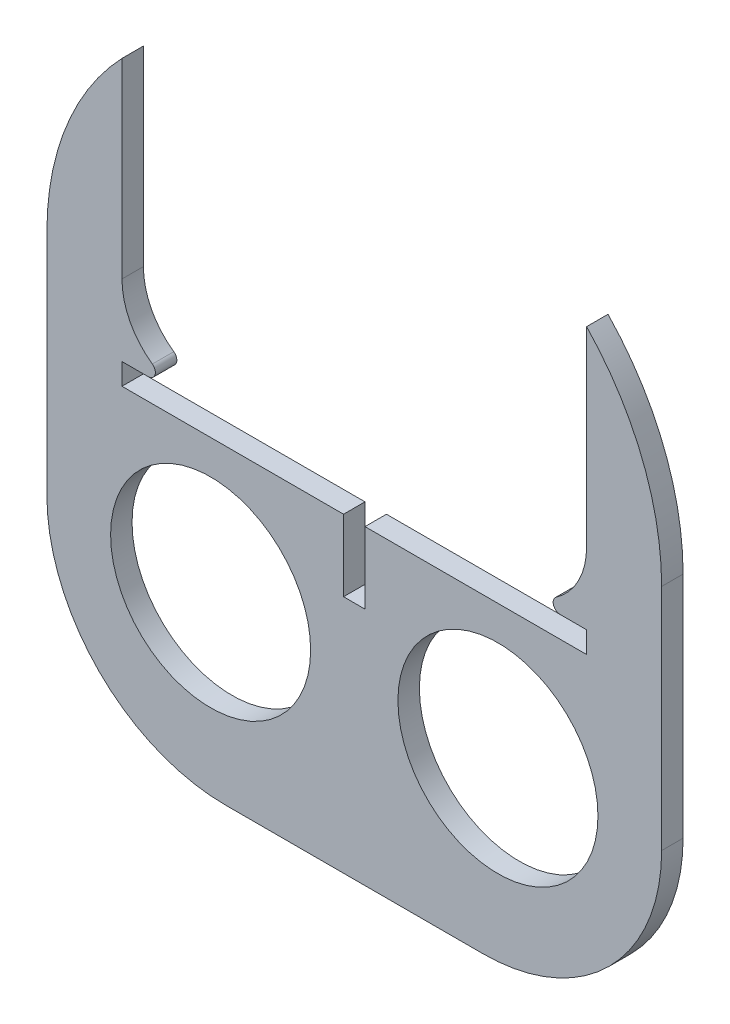
ISO-10303-21;
HEADER;
FILE_DESCRIPTION(('STEP AP214'),'2;1');
FILE_NAME('part.step','',(''),(''),'','','');
FILE_SCHEMA(('AUTOMOTIVE_DESIGN { 1 0 10303 214 1 1 1 1 }'));
ENDSEC;
DATA;
#1=APPLICATION_CONTEXT('core data for automotive mechanical design processes');
#2=APPLICATION_PROTOCOL_DEFINITION('international standard','automotive_design',2000,#1);
#3=PRODUCT_CONTEXT('',#1,'mechanical');
#4=PRODUCT('Part','Part','',(#3));
#5=PRODUCT_RELATED_PRODUCT_CATEGORY('part','',(#4));
#6=PRODUCT_DEFINITION_FORMATION('','',#4);
#7=PRODUCT_DEFINITION_CONTEXT('part definition',#1,'design');
#8=PRODUCT_DEFINITION('design','',#6,#7);
#9=PRODUCT_DEFINITION_SHAPE('','',#8);
#10=(LENGTH_UNIT() NAMED_UNIT(*) SI_UNIT(.MILLI.,.METRE.));
#11=(NAMED_UNIT(*) PLANE_ANGLE_UNIT() SI_UNIT($,.RADIAN.));
#12=(NAMED_UNIT(*) SI_UNIT($,.STERADIAN.) SOLID_ANGLE_UNIT());
#13=UNCERTAINTY_MEASURE_WITH_UNIT(LENGTH_MEASURE(1.E-05),#10,'distance_accuracy_value','');
#14=(GEOMETRIC_REPRESENTATION_CONTEXT(3) GLOBAL_UNCERTAINTY_ASSIGNED_CONTEXT((#13)) GLOBAL_UNIT_ASSIGNED_CONTEXT((#10,
#11,#12)) REPRESENTATION_CONTEXT('',''));
#15=CARTESIAN_POINT('',(0.,0.,0.));
#16=DIRECTION('',(0.,0.,1.));
#17=DIRECTION('',(1.,0.,0.));
#18=AXIS2_PLACEMENT_3D('',#15,#16,#17);
#19=CARTESIAN_POINT('',(-4.99999999999999,-29.5,3.));
#20=DIRECTION('',(0.,0.,-1.));
#21=DIRECTION('',(-1.,0.,0.));
#22=AXIS2_PLACEMENT_3D('',#19,#20,#21);
#23=PLANE('',#22);
#24=CARTESIAN_POINT('',(22.5,-30.,3.));
#25=DIRECTION('',(0.,0.,1.));
#26=DIRECTION('',(1.,0.,0.));
#27=AXIS2_PLACEMENT_3D('',#24,#25,#26);
#28=CIRCLE('',#27,10.);
#29=CARTESIAN_POINT('',(28.2495957457607,-38.1818181818182,3.));
#30=VERTEX_POINT('',#29);
#31=CARTESIAN_POINT('',(32.5,-30.,3.));
#32=VERTEX_POINT('',#31);
#33=EDGE_CURVE('E251',#30,#32,#28,.T.);
#34=ORIENTED_EDGE('',*,*,#33,.F.);
#35=CARTESIAN_POINT('',(28.8245553203367,-39.,3.));
#36=DIRECTION('',(0.,0.,-1.));
#37=DIRECTION('',(-1.,0.,0.));
#38=AXIS2_PLACEMENT_3D('',#35,#36,#37);
#39=CIRCLE('',#38,1.);
#40=CARTESIAN_POINT('',(28.8245553203367,-40.,3.));
#41=VERTEX_POINT('',#40);
#42=EDGE_CURVE('E349',#30,#41,#39,.F.);
#43=ORIENTED_EDGE('',*,*,#42,.T.);
#44=DIRECTION('',(1.,0.,0.));
#45=VECTOR('',#44,1.);
#46=CARTESIAN_POINT('',(0.,-40.,3.));
#47=LINE('',#46,#45);
#48=CARTESIAN_POINT('',(32.5,-40.,3.));
#49=VERTEX_POINT('',#48);
#50=EDGE_CURVE('E225',#41,#49,#47,.T.);
#51=ORIENTED_EDGE('',*,*,#50,.T.);
#52=DIRECTION('',(0.,1.,0.));
#53=VECTOR('',#52,1.);
#54=CARTESIAN_POINT('',(32.5,0.,3.));
#55=LINE('',#54,#53);
#56=CARTESIAN_POINT('',(32.5,-43.,3.));
#57=VERTEX_POINT('',#56);
#58=EDGE_CURVE('E222',#57,#49,#55,.T.);
#59=ORIENTED_EDGE('',*,*,#58,.F.);
#60=DIRECTION('',(1.,0.,0.));
#61=VECTOR('',#60,1.);
#62=CARTESIAN_POINT('',(0.,-43.,3.));
#63=LINE('',#62,#61);
#64=CARTESIAN_POINT('',(1.5,-43.,3.));
#65=VERTEX_POINT('',#64);
#66=EDGE_CURVE('E209',#65,#57,#63,.T.);
#67=ORIENTED_EDGE('',*,*,#66,.F.);
#68=DIRECTION('',(0.,1.,0.));
#69=VECTOR('',#68,1.);
#70=CARTESIAN_POINT('',(1.5,0.,3.));
#71=LINE('',#70,#69);
#72=CARTESIAN_POINT('',(1.5,-53.,3.));
#73=VERTEX_POINT('',#72);
#74=EDGE_CURVE('E216',#73,#65,#71,.T.);
#75=ORIENTED_EDGE('',*,*,#74,.F.);
#76=DIRECTION('',(1.,0.,0.));
#77=VECTOR('',#76,1.);
#78=CARTESIAN_POINT('',(0.,-53.,3.));
#79=LINE('',#78,#77);
#80=CARTESIAN_POINT('',(-1.5,-53.,3.));
#81=VERTEX_POINT('',#80);
#82=EDGE_CURVE('E214',#81,#73,#79,.T.);
#83=ORIENTED_EDGE('',*,*,#82,.F.);
#84=DIRECTION('',(0.,1.,0.));
#85=VECTOR('',#84,1.);
#86=CARTESIAN_POINT('',(-1.5,0.,3.));
#87=LINE('',#86,#85);
#88=CARTESIAN_POINT('',(-1.5,-43.,3.));
#89=VERTEX_POINT('',#88);
#90=EDGE_CURVE('E190',#81,#89,#87,.T.);
#91=ORIENTED_EDGE('',*,*,#90,.T.);
#92=CARTESIAN_POINT('',(-32.5,-43.,3.));
#93=VERTEX_POINT('',#92);
#94=EDGE_CURVE('E200',#93,#89,#63,.T.);
#95=ORIENTED_EDGE('',*,*,#94,.F.);
#96=DIRECTION('',(0.,1.,0.));
#97=VECTOR('',#96,1.);
#98=CARTESIAN_POINT('',(-32.5,0.,3.));
#99=LINE('',#98,#97);
#100=CARTESIAN_POINT('',(-32.5,-40.,3.));
#101=VERTEX_POINT('',#100);
#102=EDGE_CURVE('E197',#93,#101,#99,.T.);
#103=ORIENTED_EDGE('',*,*,#102,.T.);
#104=CARTESIAN_POINT('',(-28.8245553203368,-40.,3.));
#105=VERTEX_POINT('',#104);
#106=EDGE_CURVE('E226',#101,#105,#47,.T.);
#107=ORIENTED_EDGE('',*,*,#106,.T.);
#108=CARTESIAN_POINT('',(-28.8245553203368,-39.,3.));
#109=DIRECTION('',(0.,0.,-1.));
#110=DIRECTION('',(-1.,0.,0.));
#111=AXIS2_PLACEMENT_3D('',#108,#109,#110);
#112=CIRCLE('',#111,1.);
#113=CARTESIAN_POINT('',(-28.2495957457607,-38.1818181818182,3.));
#114=VERTEX_POINT('',#113);
#115=EDGE_CURVE('E347',#105,#114,#112,.F.);
#116=ORIENTED_EDGE('',*,*,#115,.T.);
#117=CARTESIAN_POINT('',(-22.5,-30.,3.));
#118=DIRECTION('',(0.,0.,1.));
#119=DIRECTION('',(-1.,0.,0.));
#120=AXIS2_PLACEMENT_3D('',#117,#118,#119);
#121=CIRCLE('',#120,10.);
#122=CARTESIAN_POINT('',(-32.5,-30.,3.));
#123=VERTEX_POINT('',#122);
#124=EDGE_CURVE('E249',#123,#114,#121,.T.);
#125=ORIENTED_EDGE('',*,*,#124,.F.);
#126=DIRECTION('',(0.,-1.,0.));
#127=VECTOR('',#126,1.);
#128=CARTESIAN_POINT('',(-32.5,-30.,3.));
#129=LINE('',#128,#127);
#130=CARTESIAN_POINT('',(-32.5,-3.27501191611332,3.));
#131=VERTEX_POINT('',#130);
#132=EDGE_CURVE('E246',#131,#123,#129,.T.);
#133=ORIENTED_EDGE('',*,*,#132,.F.);
#134=CARTESIAN_POINT('',(-4.99999999999999,-29.5,3.));
#135=DIRECTION('',(0.,0.,1.));
#136=DIRECTION('',(-1.,0.,0.));
#137=AXIS2_PLACEMENT_3D('',#134,#135,#136);
#138=CIRCLE('',#137,38.);
#139=CARTESIAN_POINT('',(-43.,-29.5,3.));
#140=VERTEX_POINT('',#139);
#141=EDGE_CURVE('E267',#131,#140,#138,.T.);
#142=ORIENTED_EDGE('',*,*,#141,.T.);
#143=DIRECTION('',(0.,-1.,0.));
#144=VECTOR('',#143,1.);
#145=CARTESIAN_POINT('',(-43.,-29.5,3.));
#146=LINE('',#145,#144);
#147=CARTESIAN_POINT('',(-43.,-61.5,3.));
#148=VERTEX_POINT('',#147);
#149=EDGE_CURVE('E269',#140,#148,#146,.T.);
#150=ORIENTED_EDGE('',*,*,#149,.T.);
#151=CARTESIAN_POINT('',(-18.,-61.5,3.));
#152=DIRECTION('',(0.,0.,1.));
#153=DIRECTION('',(1.,0.,0.));
#154=AXIS2_PLACEMENT_3D('',#151,#152,#153);
#155=CIRCLE('',#154,25.);
#156=CARTESIAN_POINT('',(-18.,-86.5,3.));
#157=VERTEX_POINT('',#156);
#158=EDGE_CURVE('E272',#148,#157,#155,.T.);
#159=ORIENTED_EDGE('',*,*,#158,.T.);
#160=DIRECTION('',(1.,0.,0.));
#161=VECTOR('',#160,1.);
#162=CARTESIAN_POINT('',(-18.,-86.5,3.));
#163=LINE('',#162,#161);
#164=CARTESIAN_POINT('',(18.,-86.5,3.));
#165=VERTEX_POINT('',#164);
#166=EDGE_CURVE('E274',#157,#165,#163,.T.);
#167=ORIENTED_EDGE('',*,*,#166,.T.);
#168=CARTESIAN_POINT('',(18.,-61.5,3.));
#169=DIRECTION('',(0.,0.,1.));
#170=DIRECTION('',(1.,0.,0.));
#171=AXIS2_PLACEMENT_3D('',#168,#169,#170);
#172=CIRCLE('',#171,25.);
#173=CARTESIAN_POINT('',(43.,-61.5,3.));
#174=VERTEX_POINT('',#173);
#175=EDGE_CURVE('E276',#165,#174,#172,.T.);
#176=ORIENTED_EDGE('',*,*,#175,.T.);
#177=DIRECTION('',(0.,1.,0.));
#178=VECTOR('',#177,1.);
#179=CARTESIAN_POINT('',(43.,-29.5,3.));
#180=LINE('',#179,#178);
#181=CARTESIAN_POINT('',(43.,-29.5,3.));
#182=VERTEX_POINT('',#181);
#183=EDGE_CURVE('E278',#174,#182,#180,.T.);
#184=ORIENTED_EDGE('',*,*,#183,.T.);
#185=CARTESIAN_POINT('',(5.,-29.5,3.));
#186=DIRECTION('',(0.,0.,1.));
#187=DIRECTION('',(-1.,0.,0.));
#188=AXIS2_PLACEMENT_3D('',#185,#186,#187);
#189=CIRCLE('',#188,38.);
#190=CARTESIAN_POINT('',(32.5,-3.27501191611328,3.));
#191=VERTEX_POINT('',#190);
#192=EDGE_CURVE('E280',#182,#191,#189,.T.);
#193=ORIENTED_EDGE('',*,*,#192,.T.);
#194=DIRECTION('',(0.,1.,0.));
#195=VECTOR('',#194,1.);
#196=CARTESIAN_POINT('',(32.5,-30.,3.));
#197=LINE('',#196,#195);
#198=EDGE_CURVE('E253',#32,#191,#197,.T.);
#199=ORIENTED_EDGE('',*,*,#198,.F.);
#200=EDGE_LOOP('',(#34,#43,#51,#59,#67,#75,#83,#91,#95,#103,#107,#116,#125,#133,#142,#150,#159,
#167,#176,#184,#193,#199));
#201=FACE_BOUND('',#200,.T.);
#202=CARTESIAN_POINT('',(20.0977436202381,-61.7663091216652,3.));
#203=DIRECTION('',(0.,0.,-1.));
#204=DIRECTION('',(-1.,0.,0.));
#205=AXIS2_PLACEMENT_3D('',#202,#203,#204);
#206=CIRCLE('',#205,13.9918972252154);
#207=CARTESIAN_POINT('',(6.10584639502266,-61.7663091216652,3.));
#208=VERTEX_POINT('',#207);
#209=EDGE_CURVE('E727',#208,#208,#206,.T.);
#210=ORIENTED_EDGE('',*,*,#209,.T.);
#211=EDGE_LOOP('',(#210));
#212=FACE_BOUND('',#211,.T.);
#213=CARTESIAN_POINT('',(-20.0977436202381,-61.7663091216652,3.));
#214=DIRECTION('',(0.,0.,1.));
#215=DIRECTION('',(1.,0.,0.));
#216=AXIS2_PLACEMENT_3D('',#213,#214,#215);
#217=CIRCLE('',#216,13.9918972252154);
#218=CARTESIAN_POINT('',(-6.10584639502266,-61.7663091216652,3.));
#219=VERTEX_POINT('',#218);
#220=EDGE_CURVE('E342',#219,#219,#217,.T.);
#221=ORIENTED_EDGE('',*,*,#220,.F.);
#222=EDGE_LOOP('',(#221));
#223=FACE_BOUND('',#222,.T.);
#224=ADVANCED_FACE('F37',(#201,#212,#223),#23,.F.);
#225=CARTESIAN_POINT('',(-4.99999999999999,-29.5,0.));
#226=DIRECTION('',(0.,0.,-1.));
#227=DIRECTION('',(-1.,0.,0.));
#228=AXIS2_PLACEMENT_3D('',#225,#226,#227);
#229=PLANE('',#228);
#230=CARTESIAN_POINT('',(20.0977436202381,-61.7663091216652,0.));
#231=DIRECTION('',(0.,0.,-1.));
#232=DIRECTION('',(-1.,0.,0.));
#233=AXIS2_PLACEMENT_3D('',#230,#231,#232);
#234=CIRCLE('',#233,13.9918972252154);
#235=CARTESIAN_POINT('',(6.10584639502266,-61.7663091216652,0.));
#236=VERTEX_POINT('',#235);
#237=EDGE_CURVE('E339',#236,#236,#234,.F.);
#238=ORIENTED_EDGE('',*,*,#237,.T.);
#239=EDGE_LOOP('',(#238));
#240=FACE_BOUND('',#239,.T.);
#241=DIRECTION('',(-1.,0.,0.));
#242=VECTOR('',#241,1.);
#243=CARTESIAN_POINT('',(-4.99999999999999,-40.,0.));
#244=LINE('',#243,#242);
#245=CARTESIAN_POINT('',(32.5,-40.,0.));
#246=VERTEX_POINT('',#245);
#247=CARTESIAN_POINT('',(28.8245553203367,-40.,0.));
#248=VERTEX_POINT('',#247);
#249=EDGE_CURVE('E245',#246,#248,#244,.T.);
#250=ORIENTED_EDGE('',*,*,#249,.T.);
#251=CARTESIAN_POINT('',(28.8245553203367,-39.,0.));
#252=DIRECTION('',(0.,0.,-1.));
#253=DIRECTION('',(-1.,0.,0.));
#254=AXIS2_PLACEMENT_3D('',#251,#252,#253);
#255=CIRCLE('',#254,1.);
#256=CARTESIAN_POINT('',(28.2495957457607,-38.1818181818182,0.));
#257=VERTEX_POINT('',#256);
#258=EDGE_CURVE('E354',#248,#257,#255,.T.);
#259=ORIENTED_EDGE('',*,*,#258,.T.);
#260=CARTESIAN_POINT('',(22.5,-30.,0.));
#261=DIRECTION('',(0.,0.,-1.));
#262=DIRECTION('',(-1.,0.,0.));
#263=AXIS2_PLACEMENT_3D('',#260,#261,#262);
#264=CIRCLE('',#263,10.);
#265=CARTESIAN_POINT('',(32.5,-30.,0.));
#266=VERTEX_POINT('',#265);
#267=EDGE_CURVE('E319',#266,#257,#264,.T.);
#268=ORIENTED_EDGE('',*,*,#267,.F.);
#269=DIRECTION('',(0.,-1.,0.));
#270=VECTOR('',#269,1.);
#271=CARTESIAN_POINT('',(32.5,-29.5,0.));
#272=LINE('',#271,#270);
#273=CARTESIAN_POINT('',(32.5,-3.27501191611328,0.));
#274=VERTEX_POINT('',#273);
#275=EDGE_CURVE('E322',#274,#266,#272,.T.);
#276=ORIENTED_EDGE('',*,*,#275,.F.);
#277=CARTESIAN_POINT('',(5.,-29.5,0.));
#278=DIRECTION('',(0.,0.,1.));
#279=DIRECTION('',(-1.,0.,0.));
#280=AXIS2_PLACEMENT_3D('',#277,#278,#279);
#281=CIRCLE('',#280,38.);
#282=CARTESIAN_POINT('',(43.,-29.5,0.));
#283=VERTEX_POINT('',#282);
#284=EDGE_CURVE('E270',#283,#274,#281,.T.);
#285=ORIENTED_EDGE('',*,*,#284,.F.);
#286=DIRECTION('',(0.,1.,0.));
#287=VECTOR('',#286,1.);
#288=CARTESIAN_POINT('',(43.,-29.5,0.));
#289=LINE('',#288,#287);
#290=CARTESIAN_POINT('',(43.,-61.5,0.));
#291=VERTEX_POINT('',#290);
#292=EDGE_CURVE('E294',#291,#283,#289,.T.);
#293=ORIENTED_EDGE('',*,*,#292,.F.);
#294=CARTESIAN_POINT('',(18.,-61.5,0.));
#295=DIRECTION('',(0.,0.,1.));
#296=DIRECTION('',(1.,0.,0.));
#297=AXIS2_PLACEMENT_3D('',#294,#295,#296);
#298=CIRCLE('',#297,25.);
#299=CARTESIAN_POINT('',(18.,-86.5,0.));
#300=VERTEX_POINT('',#299);
#301=EDGE_CURVE('E292',#300,#291,#298,.T.);
#302=ORIENTED_EDGE('',*,*,#301,.F.);
#303=DIRECTION('',(1.,0.,0.));
#304=VECTOR('',#303,1.);
#305=CARTESIAN_POINT('',(0.500000000000011,-86.5,0.));
#306=LINE('',#305,#304);
#307=CARTESIAN_POINT('',(-18.,-86.5,0.));
#308=VERTEX_POINT('',#307);
#309=EDGE_CURVE('E290',#308,#300,#306,.T.);
#310=ORIENTED_EDGE('',*,*,#309,.F.);
#311=CARTESIAN_POINT('',(-18.,-61.5,0.));
#312=DIRECTION('',(0.,0.,1.));
#313=DIRECTION('',(1.,0.,0.));
#314=AXIS2_PLACEMENT_3D('',#311,#312,#313);
#315=CIRCLE('',#314,25.);
#316=CARTESIAN_POINT('',(-43.,-61.5,0.));
#317=VERTEX_POINT('',#316);
#318=EDGE_CURVE('E287',#317,#308,#315,.T.);
#319=ORIENTED_EDGE('',*,*,#318,.F.);
#320=DIRECTION('',(0.,-1.,0.));
#321=VECTOR('',#320,1.);
#322=CARTESIAN_POINT('',(-43.,-29.5,0.));
#323=LINE('',#322,#321);
#324=CARTESIAN_POINT('',(-43.,-29.5,0.));
#325=VERTEX_POINT('',#324);
#326=EDGE_CURVE('E285',#325,#317,#323,.T.);
#327=ORIENTED_EDGE('',*,*,#326,.F.);
#328=CARTESIAN_POINT('',(-4.99999999999999,-29.5,0.));
#329=DIRECTION('',(0.,0.,1.));
#330=DIRECTION('',(-1.,0.,0.));
#331=AXIS2_PLACEMENT_3D('',#328,#329,#330);
#332=CIRCLE('',#331,38.);
#333=CARTESIAN_POINT('',(-32.5,-3.27501191611332,0.));
#334=VERTEX_POINT('',#333);
#335=EDGE_CURVE('E266',#334,#325,#332,.T.);
#336=ORIENTED_EDGE('',*,*,#335,.F.);
#337=DIRECTION('',(0.,1.,0.));
#338=VECTOR('',#337,1.);
#339=CARTESIAN_POINT('',(-32.5,-29.5,0.));
#340=LINE('',#339,#338);
#341=CARTESIAN_POINT('',(-32.5,-30.,0.));
#342=VERTEX_POINT('',#341);
#343=EDGE_CURVE('E315',#342,#334,#340,.T.);
#344=ORIENTED_EDGE('',*,*,#343,.F.);
#345=CARTESIAN_POINT('',(-22.5,-30.,0.));
#346=DIRECTION('',(0.,0.,-1.));
#347=DIRECTION('',(-1.,0.,0.));
#348=AXIS2_PLACEMENT_3D('',#345,#346,#347);
#349=CIRCLE('',#348,10.);
#350=CARTESIAN_POINT('',(-28.2495957457607,-38.1818181818182,0.));
#351=VERTEX_POINT('',#350);
#352=EDGE_CURVE('E317',#351,#342,#349,.T.);
#353=ORIENTED_EDGE('',*,*,#352,.F.);
#354=CARTESIAN_POINT('',(-28.8245553203368,-39.,0.));
#355=DIRECTION('',(0.,0.,-1.));
#356=DIRECTION('',(-1.,0.,0.));
#357=AXIS2_PLACEMENT_3D('',#354,#355,#356);
#358=CIRCLE('',#357,1.);
#359=CARTESIAN_POINT('',(-28.8245553203368,-40.,0.));
#360=VERTEX_POINT('',#359);
#361=EDGE_CURVE('E52',#351,#360,#358,.T.);
#362=ORIENTED_EDGE('',*,*,#361,.T.);
#363=CARTESIAN_POINT('',(-32.5,-40.,0.));
#364=VERTEX_POINT('',#363);
#365=EDGE_CURVE('E231',#360,#364,#244,.T.);
#366=ORIENTED_EDGE('',*,*,#365,.T.);
#367=DIRECTION('',(0.,-1.,0.));
#368=VECTOR('',#367,1.);
#369=CARTESIAN_POINT('',(-32.5,-29.5,0.));
#370=LINE('',#369,#368);
#371=CARTESIAN_POINT('',(-32.5,-43.,0.));
#372=VERTEX_POINT('',#371);
#373=EDGE_CURVE('E335',#364,#372,#370,.T.);
#374=ORIENTED_EDGE('',*,*,#373,.T.);
#375=DIRECTION('',(-1.,0.,0.));
#376=VECTOR('',#375,1.);
#377=CARTESIAN_POINT('',(-4.99999999999999,-43.,0.));
#378=LINE('',#377,#376);
#379=CARTESIAN_POINT('',(-1.5,-43.,0.));
#380=VERTEX_POINT('',#379);
#381=EDGE_CURVE('E333',#380,#372,#378,.T.);
#382=ORIENTED_EDGE('',*,*,#381,.F.);
#383=DIRECTION('',(0.,-1.,0.));
#384=VECTOR('',#383,1.);
#385=CARTESIAN_POINT('',(-1.5,-29.5,0.));
#386=LINE('',#385,#384);
#387=CARTESIAN_POINT('',(-1.5,-53.,0.));
#388=VERTEX_POINT('',#387);
#389=EDGE_CURVE('E193',#380,#388,#386,.T.);
#390=ORIENTED_EDGE('',*,*,#389,.T.);
#391=DIRECTION('',(-1.,0.,0.));
#392=VECTOR('',#391,1.);
#393=CARTESIAN_POINT('',(-4.99999999999999,-53.,0.));
#394=LINE('',#393,#392);
#395=CARTESIAN_POINT('',(1.5,-53.,0.));
#396=VERTEX_POINT('',#395);
#397=EDGE_CURVE('E325',#396,#388,#394,.T.);
#398=ORIENTED_EDGE('',*,*,#397,.F.);
#399=DIRECTION('',(0.,-1.,0.));
#400=VECTOR('',#399,1.);
#401=CARTESIAN_POINT('',(1.5,-29.5,0.));
#402=LINE('',#401,#400);
#403=CARTESIAN_POINT('',(1.5,-43.,0.));
#404=VERTEX_POINT('',#403);
#405=EDGE_CURVE('E327',#404,#396,#402,.T.);
#406=ORIENTED_EDGE('',*,*,#405,.F.);
#407=DIRECTION('',(-1.,0.,0.));
#408=VECTOR('',#407,1.);
#409=CARTESIAN_POINT('',(-4.99999999999999,-43.,0.));
#410=LINE('',#409,#408);
#411=CARTESIAN_POINT('',(32.5,-43.,0.));
#412=VERTEX_POINT('',#411);
#413=EDGE_CURVE('E329',#412,#404,#410,.T.);
#414=ORIENTED_EDGE('',*,*,#413,.F.);
#415=DIRECTION('',(0.,-1.,0.));
#416=VECTOR('',#415,1.);
#417=CARTESIAN_POINT('',(32.5,-29.5,0.));
#418=LINE('',#417,#416);
#419=EDGE_CURVE('E331',#246,#412,#418,.T.);
#420=ORIENTED_EDGE('',*,*,#419,.F.);
#421=EDGE_LOOP('',(#250,#259,#268,#276,#285,#293,#302,#310,#319,#327,#336,#344,#353,#362,#366,
#374,#382,#390,#398,#406,#414,#420));
#422=FACE_BOUND('',#421,.T.);
#423=CARTESIAN_POINT('',(-20.0977436202381,-61.7663091216652,0.));
#424=DIRECTION('',(0.,0.,-1.));
#425=DIRECTION('',(-1.,0.,0.));
#426=AXIS2_PLACEMENT_3D('',#423,#424,#425);
#427=CIRCLE('',#426,13.9918972252154);
#428=CARTESIAN_POINT('',(-34.0896408454535,-61.7663091216652,0.));
#429=VERTEX_POINT('',#428);
#430=EDGE_CURVE('E207',#429,#429,#427,.T.);
#431=ORIENTED_EDGE('',*,*,#430,.F.);
#432=EDGE_LOOP('',(#431));
#433=FACE_BOUND('',#432,.T.);
#434=ADVANCED_FACE('F367',(#240,#422,#433),#229,.T.);
#435=CARTESIAN_POINT('',(-4.99999999999999,-29.5,3.));
#436=DIRECTION('',(0.,0.,-1.));
#437=DIRECTION('',(-1.,0.,0.));
#438=AXIS2_PLACEMENT_3D('',#435,#436,#437);
#439=CYLINDRICAL_SURFACE('',#438,38.);
#440=ORIENTED_EDGE('',*,*,#141,.F.);
#441=DIRECTION('',(0.,0.,-1.));
#442=VECTOR('',#441,1.);
#443=CARTESIAN_POINT('',(-32.5,-3.27501191611332,3.));
#444=LINE('',#443,#442);
#445=EDGE_CURVE('E259',#131,#334,#444,.T.);
#446=ORIENTED_EDGE('',*,*,#445,.T.);
#447=ORIENTED_EDGE('',*,*,#335,.T.);
#448=DIRECTION('',(0.,0.,-1.));
#449=VECTOR('',#448,1.);
#450=CARTESIAN_POINT('',(-43.,-29.5,3.));
#451=LINE('',#450,#449);
#452=EDGE_CURVE('E312',#140,#325,#451,.T.);
#453=ORIENTED_EDGE('',*,*,#452,.F.);
#454=EDGE_LOOP('',(#440,#446,#447,#453));
#455=FACE_BOUND('',#454,.T.);
#456=ADVANCED_FACE('F437',(#455),#439,.T.);
#457=CARTESIAN_POINT('',(-43.,-29.5,3.));
#458=DIRECTION('',(1.,0.,0.));
#459=DIRECTION('',(0.,0.,-1.));
#460=AXIS2_PLACEMENT_3D('',#457,#458,#459);
#461=PLANE('',#460);
#462=ORIENTED_EDGE('',*,*,#326,.T.);
#463=DIRECTION('',(0.,0.,-1.));
#464=VECTOR('',#463,1.);
#465=CARTESIAN_POINT('',(-43.,-61.5,3.));
#466=LINE('',#465,#464);
#467=EDGE_CURVE('E309',#148,#317,#466,.T.);
#468=ORIENTED_EDGE('',*,*,#467,.F.);
#469=ORIENTED_EDGE('',*,*,#149,.F.);
#470=ORIENTED_EDGE('',*,*,#452,.T.);
#471=EDGE_LOOP('',(#462,#468,#469,#470));
#472=FACE_BOUND('',#471,.T.);
#473=ADVANCED_FACE('F431',(#472),#461,.F.);
#474=CARTESIAN_POINT('',(-18.,-61.5,3.));
#475=DIRECTION('',(0.,0.,-1.));
#476=DIRECTION('',(-1.,0.,0.));
#477=AXIS2_PLACEMENT_3D('',#474,#475,#476);
#478=CYLINDRICAL_SURFACE('',#477,25.);
#479=ORIENTED_EDGE('',*,*,#318,.T.);
#480=DIRECTION('',(0.,0.,-1.));
#481=VECTOR('',#480,1.);
#482=CARTESIAN_POINT('',(-18.,-86.5,3.));
#483=LINE('',#482,#481);
#484=EDGE_CURVE('E306',#157,#308,#483,.T.);
#485=ORIENTED_EDGE('',*,*,#484,.F.);
#486=ORIENTED_EDGE('',*,*,#158,.F.);
#487=ORIENTED_EDGE('',*,*,#467,.T.);
#488=EDGE_LOOP('',(#479,#485,#486,#487));
#489=FACE_BOUND('',#488,.T.);
#490=ADVANCED_FACE('F426',(#489),#478,.T.);
#491=CARTESIAN_POINT('',(0.500000000000011,-86.5,3.));
#492=DIRECTION('',(0.,1.,0.));
#493=DIRECTION('',(-1.,0.,0.));
#494=AXIS2_PLACEMENT_3D('',#491,#492,#493);
#495=PLANE('',#494);
#496=ORIENTED_EDGE('',*,*,#309,.T.);
#497=DIRECTION('',(0.,0.,-1.));
#498=VECTOR('',#497,1.);
#499=CARTESIAN_POINT('',(18.,-86.5,3.));
#500=LINE('',#499,#498);
#501=EDGE_CURVE('E303',#165,#300,#500,.T.);
#502=ORIENTED_EDGE('',*,*,#501,.F.);
#503=ORIENTED_EDGE('',*,*,#166,.F.);
#504=ORIENTED_EDGE('',*,*,#484,.T.);
#505=EDGE_LOOP('',(#496,#502,#503,#504));
#506=FACE_BOUND('',#505,.T.);
#507=ADVANCED_FACE('F421',(#506),#495,.F.);
#508=CARTESIAN_POINT('',(18.,-61.5,3.));
#509=DIRECTION('',(0.,0.,-1.));
#510=DIRECTION('',(-1.,0.,0.));
#511=AXIS2_PLACEMENT_3D('',#508,#509,#510);
#512=CYLINDRICAL_SURFACE('',#511,25.);
#513=ORIENTED_EDGE('',*,*,#301,.T.);
#514=DIRECTION('',(0.,0.,-1.));
#515=VECTOR('',#514,1.);
#516=CARTESIAN_POINT('',(43.,-61.5,3.));
#517=LINE('',#516,#515);
#518=EDGE_CURVE('E300',#174,#291,#517,.T.);
#519=ORIENTED_EDGE('',*,*,#518,.F.);
#520=ORIENTED_EDGE('',*,*,#175,.F.);
#521=ORIENTED_EDGE('',*,*,#501,.T.);
#522=EDGE_LOOP('',(#513,#519,#520,#521));
#523=FACE_BOUND('',#522,.T.);
#524=ADVANCED_FACE('F417',(#523),#512,.T.);
#525=CARTESIAN_POINT('',(43.,-29.5,3.));
#526=DIRECTION('',(-1.,0.,0.));
#527=DIRECTION('',(0.,0.,1.));
#528=AXIS2_PLACEMENT_3D('',#525,#526,#527);
#529=PLANE('',#528);
#530=ORIENTED_EDGE('',*,*,#292,.T.);
#531=DIRECTION('',(0.,0.,-1.));
#532=VECTOR('',#531,1.);
#533=CARTESIAN_POINT('',(43.,-29.5,3.));
#534=LINE('',#533,#532);
#535=EDGE_CURVE('E283',#182,#283,#534,.T.);
#536=ORIENTED_EDGE('',*,*,#535,.F.);
#537=ORIENTED_EDGE('',*,*,#183,.F.);
#538=ORIENTED_EDGE('',*,*,#518,.T.);
#539=EDGE_LOOP('',(#530,#536,#537,#538));
#540=FACE_BOUND('',#539,.T.);
#541=ADVANCED_FACE('F413',(#540),#529,.F.);
#542=CARTESIAN_POINT('',(5.,-29.5,3.));
#543=DIRECTION('',(0.,0.,-1.));
#544=DIRECTION('',(-1.,0.,0.));
#545=AXIS2_PLACEMENT_3D('',#542,#543,#544);
#546=CYLINDRICAL_SURFACE('',#545,38.);
#547=ORIENTED_EDGE('',*,*,#284,.T.);
#548=DIRECTION('',(0.,0.,-1.));
#549=VECTOR('',#548,1.);
#550=CARTESIAN_POINT('',(32.5,-3.27501191611328,3.));
#551=LINE('',#550,#549);
#552=EDGE_CURVE('E263',#274,#191,#551,.F.);
#553=ORIENTED_EDGE('',*,*,#552,.T.);
#554=ORIENTED_EDGE('',*,*,#192,.F.);
#555=ORIENTED_EDGE('',*,*,#535,.T.);
#556=EDGE_LOOP('',(#547,#553,#554,#555));
#557=FACE_BOUND('',#556,.T.);
#558=ADVANCED_FACE('F408',(#557),#546,.T.);
#559=CARTESIAN_POINT('',(32.5,-30.,-7.));
#560=DIRECTION('',(1.,0.,0.));
#561=DIRECTION('',(0.,1.,0.));
#562=AXIS2_PLACEMENT_3D('',#559,#560,#561);
#563=PLANE('',#562);
#564=ORIENTED_EDGE('',*,*,#275,.T.);
#565=DIRECTION('',(0.,0.,1.));
#566=VECTOR('',#565,1.);
#567=CARTESIAN_POINT('',(32.5,-30.,-7.));
#568=LINE('',#567,#566);
#569=EDGE_CURVE('E256',#266,#32,#568,.T.);
#570=ORIENTED_EDGE('',*,*,#569,.T.);
#571=ORIENTED_EDGE('',*,*,#198,.T.);
#572=ORIENTED_EDGE('',*,*,#552,.F.);
#573=EDGE_LOOP('',(#564,#570,#571,#572));
#574=FACE_BOUND('',#573,.T.);
#575=ADVANCED_FACE('F403',(#574),#563,.F.);
#576=CARTESIAN_POINT('',(-32.5,-30.,-7.));
#577=DIRECTION('',(-1.,0.,0.));
#578=DIRECTION('',(0.,-1.,0.));
#579=AXIS2_PLACEMENT_3D('',#576,#577,#578);
#580=PLANE('',#579);
#581=ORIENTED_EDGE('',*,*,#132,.T.);
#582=DIRECTION('',(0.,0.,1.));
#583=VECTOR('',#582,1.);
#584=CARTESIAN_POINT('',(-32.5,-30.,-7.));
#585=LINE('',#584,#583);
#586=EDGE_CURVE('E255',#342,#123,#585,.T.);
#587=ORIENTED_EDGE('',*,*,#586,.F.);
#588=ORIENTED_EDGE('',*,*,#343,.T.);
#589=ORIENTED_EDGE('',*,*,#445,.F.);
#590=EDGE_LOOP('',(#581,#587,#588,#589));
#591=FACE_BOUND('',#590,.T.);
#592=ADVANCED_FACE('F440',(#591),#580,.F.);
#593=CARTESIAN_POINT('',(22.5,-30.,-7.));
#594=DIRECTION('',(0.,0.,1.));
#595=DIRECTION('',(1.,0.,0.));
#596=AXIS2_PLACEMENT_3D('',#593,#594,#595);
#597=CYLINDRICAL_SURFACE('',#596,10.);
#598=ORIENTED_EDGE('',*,*,#267,.T.);
#599=DIRECTION('',(0.,0.,1.));
#600=VECTOR('',#599,1.);
#601=CARTESIAN_POINT('',(28.2495957457607,-38.1818181818182,-7.));
#602=LINE('',#601,#600);
#603=EDGE_CURVE('E338',#257,#30,#602,.T.);
#604=ORIENTED_EDGE('',*,*,#603,.T.);
#605=ORIENTED_EDGE('',*,*,#33,.T.);
#606=ORIENTED_EDGE('',*,*,#569,.F.);
#607=EDGE_LOOP('',(#598,#604,#605,#606));
#608=FACE_BOUND('',#607,.T.);
#609=ADVANCED_FACE('F400',(#608),#597,.F.);
#610=CARTESIAN_POINT('',(-22.5,-30.,-7.));
#611=DIRECTION('',(0.,0.,1.));
#612=DIRECTION('',(1.,0.,0.));
#613=AXIS2_PLACEMENT_3D('',#610,#611,#612);
#614=CYLINDRICAL_SURFACE('',#613,10.);
#615=ORIENTED_EDGE('',*,*,#124,.T.);
#616=DIRECTION('',(0.,0.,1.));
#617=VECTOR('',#616,1.);
#618=CARTESIAN_POINT('',(-28.2495957457607,-38.1818181818182,-7.));
#619=LINE('',#618,#617);
#620=EDGE_CURVE('E11',#114,#351,#619,.F.);
#621=ORIENTED_EDGE('',*,*,#620,.T.);
#622=ORIENTED_EDGE('',*,*,#352,.T.);
#623=ORIENTED_EDGE('',*,*,#586,.T.);
#624=EDGE_LOOP('',(#615,#621,#622,#623));
#625=FACE_BOUND('',#624,.T.);
#626=ADVANCED_FACE('F442',(#625),#614,.F.);
#627=CARTESIAN_POINT('',(0.,-40.,-7.));
#628=DIRECTION('',(0.,-1.,0.));
#629=DIRECTION('',(0.,0.,-1.));
#630=AXIS2_PLACEMENT_3D('',#627,#628,#629);
#631=PLANE('',#630);
#632=ORIENTED_EDGE('',*,*,#50,.F.);
#633=DIRECTION('',(0.,0.,-1.));
#634=VECTOR('',#633,1.);
#635=CARTESIAN_POINT('',(28.8245553203367,-40.,0.));
#636=LINE('',#635,#634);
#637=EDGE_CURVE('E351',#41,#248,#636,.T.);
#638=ORIENTED_EDGE('',*,*,#637,.T.);
#639=ORIENTED_EDGE('',*,*,#249,.F.);
#640=DIRECTION('',(0.,0.,1.));
#641=VECTOR('',#640,1.);
#642=CARTESIAN_POINT('',(32.5,-40.,-7.));
#643=LINE('',#642,#641);
#644=EDGE_CURVE('E234',#246,#49,#643,.T.);
#645=ORIENTED_EDGE('',*,*,#644,.T.);
#646=EDGE_LOOP('',(#632,#638,#639,#645));
#647=FACE_BOUND('',#646,.T.);
#648=ADVANCED_FACE('F391',(#647),#631,.T.);
#649=CARTESIAN_POINT('',(0.,-43.,-7.));
#650=DIRECTION('',(0.,-1.,0.));
#651=DIRECTION('',(0.,0.,-1.));
#652=AXIS2_PLACEMENT_3D('',#649,#650,#651);
#653=PLANE('',#652);
#654=ORIENTED_EDGE('',*,*,#381,.T.);
#655=DIRECTION('',(0.,0.,1.));
#656=VECTOR('',#655,1.);
#657=CARTESIAN_POINT('',(-32.5,-43.,-7.));
#658=LINE('',#657,#656);
#659=EDGE_CURVE('E203',#372,#93,#658,.T.);
#660=ORIENTED_EDGE('',*,*,#659,.T.);
#661=ORIENTED_EDGE('',*,*,#94,.T.);
#662=DIRECTION('',(0.,0.,1.));
#663=VECTOR('',#662,1.);
#664=CARTESIAN_POINT('',(-1.5,-43.,-7.));
#665=LINE('',#664,#663);
#666=EDGE_CURVE('E185',#380,#89,#665,.T.);
#667=ORIENTED_EDGE('',*,*,#666,.F.);
#668=EDGE_LOOP('',(#654,#660,#661,#667));
#669=FACE_BOUND('',#668,.T.);
#670=ADVANCED_FACE('F201',(#669),#653,.F.);
#671=CARTESIAN_POINT('',(-32.5,0.,-7.));
#672=DIRECTION('',(1.,0.,0.));
#673=DIRECTION('',(0.,0.,-1.));
#674=AXIS2_PLACEMENT_3D('',#671,#672,#673);
#675=PLANE('',#674);
#676=DIRECTION('',(0.,0.,1.));
#677=VECTOR('',#676,1.);
#678=CARTESIAN_POINT('',(-32.5,-40.,-7.));
#679=LINE('',#678,#677);
#680=EDGE_CURVE('E232',#364,#101,#679,.T.);
#681=ORIENTED_EDGE('',*,*,#680,.T.);
#682=ORIENTED_EDGE('',*,*,#102,.F.);
#683=ORIENTED_EDGE('',*,*,#659,.F.);
#684=ORIENTED_EDGE('',*,*,#373,.F.);
#685=EDGE_LOOP('',(#681,#682,#683,#684));
#686=FACE_BOUND('',#685,.T.);
#687=ADVANCED_FACE('F364',(#686),#675,.T.);
#688=ORIENTED_EDGE('',*,*,#365,.F.);
#689=DIRECTION('',(0.,0.,-1.));
#690=VECTOR('',#689,1.);
#691=CARTESIAN_POINT('',(-28.8245553203368,-40.,3.));
#692=LINE('',#691,#690);
#693=EDGE_CURVE('E45',#360,#105,#692,.F.);
#694=ORIENTED_EDGE('',*,*,#693,.T.);
#695=ORIENTED_EDGE('',*,*,#106,.F.);
#696=ORIENTED_EDGE('',*,*,#680,.F.);
#697=EDGE_LOOP('',(#688,#694,#695,#696));
#698=FACE_BOUND('',#697,.T.);
#699=ADVANCED_FACE('F359',(#698),#631,.T.);
#700=CARTESIAN_POINT('',(32.5,0.,-7.));
#701=DIRECTION('',(1.,0.,0.));
#702=DIRECTION('',(0.,0.,-1.));
#703=AXIS2_PLACEMENT_3D('',#700,#701,#702);
#704=PLANE('',#703);
#705=ORIENTED_EDGE('',*,*,#419,.T.);
#706=DIRECTION('',(0.,0.,1.));
#707=VECTOR('',#706,1.);
#708=CARTESIAN_POINT('',(32.5,-43.,-7.));
#709=LINE('',#708,#707);
#710=EDGE_CURVE('E237',#412,#57,#709,.T.);
#711=ORIENTED_EDGE('',*,*,#710,.T.);
#712=ORIENTED_EDGE('',*,*,#58,.T.);
#713=ORIENTED_EDGE('',*,*,#644,.F.);
#714=EDGE_LOOP('',(#705,#711,#712,#713));
#715=FACE_BOUND('',#714,.T.);
#716=ADVANCED_FACE('F388',(#715),#704,.F.);
#717=ORIENTED_EDGE('',*,*,#413,.T.);
#718=DIRECTION('',(0.,0.,1.));
#719=VECTOR('',#718,1.);
#720=CARTESIAN_POINT('',(1.5,-43.,-7.));
#721=LINE('',#720,#719);
#722=EDGE_CURVE('E239',#404,#65,#721,.T.);
#723=ORIENTED_EDGE('',*,*,#722,.T.);
#724=ORIENTED_EDGE('',*,*,#66,.T.);
#725=ORIENTED_EDGE('',*,*,#710,.F.);
#726=EDGE_LOOP('',(#717,#723,#724,#725));
#727=FACE_BOUND('',#726,.T.);
#728=ADVANCED_FACE('F381',(#727),#653,.F.);
#729=CARTESIAN_POINT('',(1.5,0.,-7.));
#730=DIRECTION('',(1.,0.,0.));
#731=DIRECTION('',(0.,0.,-1.));
#732=AXIS2_PLACEMENT_3D('',#729,#730,#731);
#733=PLANE('',#732);
#734=ORIENTED_EDGE('',*,*,#405,.T.);
#735=DIRECTION('',(0.,0.,1.));
#736=VECTOR('',#735,1.);
#737=CARTESIAN_POINT('',(1.5,-53.,-7.));
#738=LINE('',#737,#736);
#739=EDGE_CURVE('E241',#396,#73,#738,.T.);
#740=ORIENTED_EDGE('',*,*,#739,.T.);
#741=ORIENTED_EDGE('',*,*,#74,.T.);
#742=ORIENTED_EDGE('',*,*,#722,.F.);
#743=EDGE_LOOP('',(#734,#740,#741,#742));
#744=FACE_BOUND('',#743,.T.);
#745=ADVANCED_FACE('F376',(#744),#733,.F.);
#746=CARTESIAN_POINT('',(0.,-53.,-7.));
#747=DIRECTION('',(0.,-1.,0.));
#748=DIRECTION('',(0.,0.,-1.));
#749=AXIS2_PLACEMENT_3D('',#746,#747,#748);
#750=PLANE('',#749);
#751=ORIENTED_EDGE('',*,*,#397,.T.);
#752=DIRECTION('',(0.,0.,1.));
#753=VECTOR('',#752,1.);
#754=CARTESIAN_POINT('',(-1.5,-53.,-7.));
#755=LINE('',#754,#753);
#756=EDGE_CURVE('E196',#388,#81,#755,.T.);
#757=ORIENTED_EDGE('',*,*,#756,.T.);
#758=ORIENTED_EDGE('',*,*,#82,.T.);
#759=ORIENTED_EDGE('',*,*,#739,.F.);
#760=EDGE_LOOP('',(#751,#757,#758,#759));
#761=FACE_BOUND('',#760,.T.);
#762=ADVANCED_FACE('F374',(#761),#750,.F.);
#763=CARTESIAN_POINT('',(-1.5,0.,-7.));
#764=DIRECTION('',(1.,0.,0.));
#765=DIRECTION('',(0.,0.,-1.));
#766=AXIS2_PLACEMENT_3D('',#763,#764,#765);
#767=PLANE('',#766);
#768=ORIENTED_EDGE('',*,*,#666,.T.);
#769=ORIENTED_EDGE('',*,*,#90,.F.);
#770=ORIENTED_EDGE('',*,*,#756,.F.);
#771=ORIENTED_EDGE('',*,*,#389,.F.);
#772=EDGE_LOOP('',(#768,#769,#770,#771));
#773=FACE_BOUND('',#772,.T.);
#774=ADVANCED_FACE('F187',(#773),#767,.T.);
#775=CARTESIAN_POINT('',(20.0977436202381,-61.7663091216652,-7.));
#776=DIRECTION('',(0.,0.,1.));
#777=DIRECTION('',(1.,0.,0.));
#778=AXIS2_PLACEMENT_3D('',#775,#776,#777);
#779=CYLINDRICAL_SURFACE('',#778,13.9918972252154);
#780=ORIENTED_EDGE('',*,*,#237,.F.);
#781=EDGE_LOOP('',(#780));
#782=FACE_BOUND('',#781,.T.);
#783=ORIENTED_EDGE('',*,*,#209,.F.);
#784=EDGE_LOOP('',(#783));
#785=FACE_BOUND('',#784,.T.);
#786=ADVANCED_FACE('F574',(#782,#785),#779,.F.);
#787=CARTESIAN_POINT('',(-20.0977436202381,-61.7663091216652,-7.));
#788=DIRECTION('',(0.,0.,1.));
#789=DIRECTION('',(1.,0.,0.));
#790=AXIS2_PLACEMENT_3D('',#787,#788,#789);
#791=CYLINDRICAL_SURFACE('',#790,13.9918972252154);
#792=ORIENTED_EDGE('',*,*,#430,.T.);
#793=EDGE_LOOP('',(#792));
#794=FACE_BOUND('',#793,.T.);
#795=ORIENTED_EDGE('',*,*,#220,.T.);
#796=EDGE_LOOP('',(#795));
#797=FACE_BOUND('',#796,.T.);
#798=ADVANCED_FACE('F447',(#794,#797),#791,.F.);
#799=CARTESIAN_POINT('',(28.8245553203367,-39.,-7.));
#800=DIRECTION('',(0.,0.,1.));
#801=DIRECTION('',(1.,0.,0.));
#802=AXIS2_PLACEMENT_3D('',#799,#800,#801);
#803=CYLINDRICAL_SURFACE('',#802,1.);
#804=ORIENTED_EDGE('',*,*,#258,.F.);
#805=ORIENTED_EDGE('',*,*,#637,.F.);
#806=ORIENTED_EDGE('',*,*,#42,.F.);
#807=ORIENTED_EDGE('',*,*,#603,.F.);
#808=EDGE_LOOP('',(#804,#805,#806,#807));
#809=FACE_BOUND('',#808,.T.);
#810=ADVANCED_FACE('F394',(#809),#803,.T.);
#811=CARTESIAN_POINT('',(-28.8245553203368,-39.,-7.));
#812=DIRECTION('',(0.,0.,1.));
#813=DIRECTION('',(1.,0.,0.));
#814=AXIS2_PLACEMENT_3D('',#811,#812,#813);
#815=CYLINDRICAL_SURFACE('',#814,1.);
#816=ORIENTED_EDGE('',*,*,#361,.F.);
#817=ORIENTED_EDGE('',*,*,#620,.F.);
#818=ORIENTED_EDGE('',*,*,#115,.F.);
#819=ORIENTED_EDGE('',*,*,#693,.F.);
#820=EDGE_LOOP('',(#816,#817,#818,#819));
#821=FACE_BOUND('',#820,.T.);
#822=ADVANCED_FACE('F39',(#821),#815,.T.);
#823=CLOSED_SHELL('',(#224,#434,#456,#473,#490,#507,#524,#541,#558,#575,#592,#609,#626,#648,
#670,#687,#699,#716,#728,#745,#762,#774,#786,#798,#810,#822));
#824=MANIFOLD_SOLID_BREP('B2',#823);
#825=ADVANCED_BREP_SHAPE_REPRESENTATION('',(#18,#824),#14);
#826=SHAPE_DEFINITION_REPRESENTATION(#9,#825);
ENDSEC;
END-ISO-10303-21;
